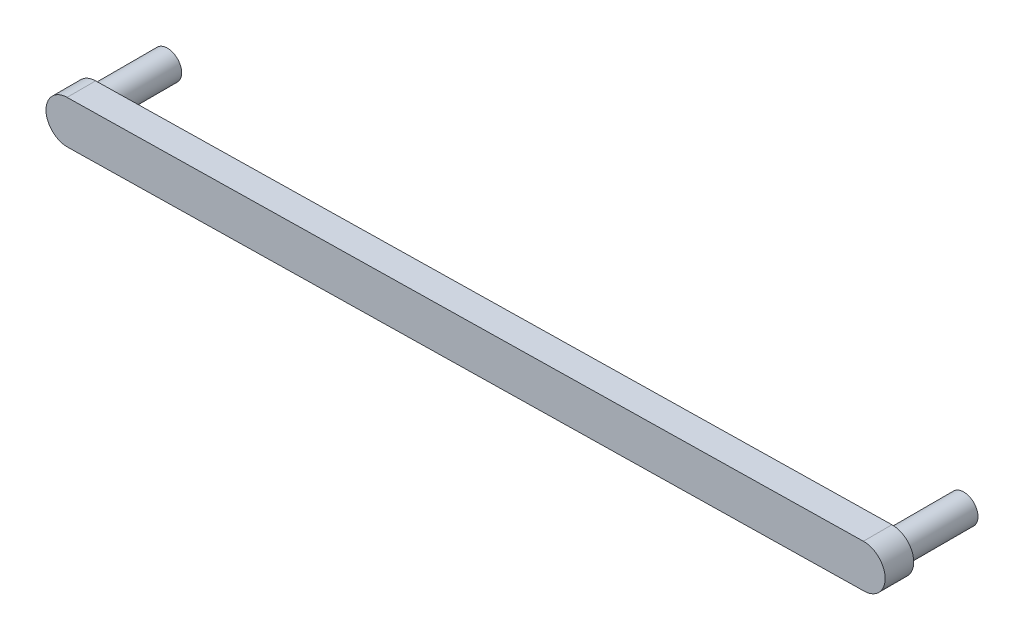
ISO-10303-21;
HEADER;
FILE_DESCRIPTION(('STEP AP214'),'2;1');
FILE_NAME('part.step','',(''),(''),'','','');
FILE_SCHEMA(('AUTOMOTIVE_DESIGN { 1 0 10303 214 1 1 1 1 }'));
ENDSEC;
DATA;
#1=APPLICATION_CONTEXT('core data for automotive mechanical design processes');
#2=APPLICATION_PROTOCOL_DEFINITION('international standard','automotive_design',2000,#1);
#3=PRODUCT_CONTEXT('',#1,'mechanical');
#4=PRODUCT('Part','Part','',(#3));
#5=PRODUCT_RELATED_PRODUCT_CATEGORY('part','',(#4));
#6=PRODUCT_DEFINITION_FORMATION('','',#4);
#7=PRODUCT_DEFINITION_CONTEXT('part definition',#1,'design');
#8=PRODUCT_DEFINITION('design','',#6,#7);
#9=PRODUCT_DEFINITION_SHAPE('','',#8);
#10=(LENGTH_UNIT() NAMED_UNIT(*) SI_UNIT(.MILLI.,.METRE.));
#11=(NAMED_UNIT(*) PLANE_ANGLE_UNIT() SI_UNIT($,.RADIAN.));
#12=(NAMED_UNIT(*) SI_UNIT($,.STERADIAN.) SOLID_ANGLE_UNIT());
#13=UNCERTAINTY_MEASURE_WITH_UNIT(LENGTH_MEASURE(1.E-05),#10,'distance_accuracy_value','');
#14=(GEOMETRIC_REPRESENTATION_CONTEXT(3) GLOBAL_UNCERTAINTY_ASSIGNED_CONTEXT((#13)) GLOBAL_UNIT_ASSIGNED_CONTEXT((#10,
#11,#12)) REPRESENTATION_CONTEXT('',''));
#15=CARTESIAN_POINT('',(0.,0.,0.));
#16=DIRECTION('',(0.,0.,1.));
#17=DIRECTION('',(1.,0.,0.));
#18=AXIS2_PLACEMENT_3D('',#15,#16,#17);
#19=CARTESIAN_POINT('',(0.,-14.9999999999999,2.));
#20=DIRECTION('',(0.,0.,-1.));
#21=DIRECTION('',(-1.,0.,0.));
#22=AXIS2_PLACEMENT_3D('',#19,#20,#21);
#23=CYLINDRICAL_SURFACE('',#22,1.5);
#24=CARTESIAN_POINT('',(0.,-14.9999999999999,0.));
#25=DIRECTION('',(0.,0.,1.));
#26=DIRECTION('',(1.,0.,0.));
#27=AXIS2_PLACEMENT_3D('',#24,#25,#26);
#28=CIRCLE('',#27,1.5);
#29=CARTESIAN_POINT('',(-0.0259093270383533,-13.5002237811017,0.));
#30=VERTEX_POINT('',#29);
#31=CARTESIAN_POINT('',(0.0259093270383072,-16.499776218898,0.));
#32=VERTEX_POINT('',#31);
#33=EDGE_CURVE('E96',#30,#32,#28,.T.);
#34=ORIENTED_EDGE('',*,*,#33,.T.);
#35=DIRECTION('',(0.,0.,-1.));
#36=VECTOR('',#35,1.);
#37=CARTESIAN_POINT('',(0.0259093270383072,-16.499776218898,2.));
#38=LINE('',#37,#36);
#39=CARTESIAN_POINT('',(0.0259093270383072,-16.499776218898,2.));
#40=VERTEX_POINT('',#39);
#41=EDGE_CURVE('E11',#40,#32,#38,.T.);
#42=ORIENTED_EDGE('',*,*,#41,.F.);
#43=CARTESIAN_POINT('',(0.,-14.9999999999999,2.));
#44=DIRECTION('',(0.,0.,1.));
#45=DIRECTION('',(1.,0.,0.));
#46=AXIS2_PLACEMENT_3D('',#43,#44,#45);
#47=CIRCLE('',#46,1.5);
#48=CARTESIAN_POINT('',(-0.0259093270383533,-13.5002237811017,2.));
#49=VERTEX_POINT('',#48);
#50=EDGE_CURVE('E82',#49,#40,#47,.T.);
#51=ORIENTED_EDGE('',*,*,#50,.F.);
#52=DIRECTION('',(0.,0.,-1.));
#53=VECTOR('',#52,1.);
#54=CARTESIAN_POINT('',(-0.0259093270383533,-13.5002237811017,2.));
#55=LINE('',#54,#53);
#56=EDGE_CURVE('E49',#49,#30,#55,.T.);
#57=ORIENTED_EDGE('',*,*,#56,.T.);
#58=EDGE_LOOP('',(#34,#42,#51,#57));
#59=FACE_BOUND('',#58,.T.);
#60=ADVANCED_FACE('F33',(#59),#23,.T.);
#61=CARTESIAN_POINT('',(0.0259093270383072,-16.499776218898,2.));
#62=DIRECTION('',(-0.0172728846922202,0.999850812598764,0.));
#63=DIRECTION('',(-0.999850812598764,-0.0172728846922202,0.));
#64=AXIS2_PLACEMENT_3D('',#61,#62,#63);
#65=PLANE('',#64);
#66=DIRECTION('',(0.999850812598764,0.0172728846922202,0.));
#67=VECTOR('',#66,1.);
#68=CARTESIAN_POINT('',(0.0259093270383072,-16.499776218898,0.));
#69=LINE('',#68,#67);
#70=CARTESIAN_POINT('',(55.779080558548,-15.5366144293862,0.));
#71=VERTEX_POINT('',#70);
#72=EDGE_CURVE('E87',#32,#71,#69,.T.);
#73=ORIENTED_EDGE('',*,*,#72,.T.);
#74=DIRECTION('',(0.,0.,-1.));
#75=VECTOR('',#74,1.);
#76=CARTESIAN_POINT('',(55.779080558548,-15.5366144293862,2.));
#77=LINE('',#76,#75);
#78=CARTESIAN_POINT('',(55.779080558548,-15.5366144293862,2.));
#79=VERTEX_POINT('',#78);
#80=EDGE_CURVE('E41',#79,#71,#77,.T.);
#81=ORIENTED_EDGE('',*,*,#80,.F.);
#82=DIRECTION('',(0.999850812598764,0.0172728846922202,0.));
#83=VECTOR('',#82,1.);
#84=CARTESIAN_POINT('',(0.0259093270383072,-16.499776218898,2.));
#85=LINE('',#84,#83);
#86=EDGE_CURVE('E75',#40,#79,#85,.T.);
#87=ORIENTED_EDGE('',*,*,#86,.F.);
#88=ORIENTED_EDGE('',*,*,#41,.T.);
#89=EDGE_LOOP('',(#73,#81,#87,#88));
#90=FACE_BOUND('',#89,.T.);
#91=ADVANCED_FACE('F86',(#90),#65,.F.);
#92=CARTESIAN_POINT('',(55.7531712315096,-14.036838210488,2.));
#93=DIRECTION('',(0.,0.,-1.));
#94=DIRECTION('',(-1.,0.,0.));
#95=AXIS2_PLACEMENT_3D('',#92,#93,#94);
#96=CYLINDRICAL_SURFACE('',#95,1.5);
#97=CARTESIAN_POINT('',(55.7531712315096,-14.036838210488,0.));
#98=DIRECTION('',(0.,0.,1.));
#99=DIRECTION('',(1.,0.,0.));
#100=AXIS2_PLACEMENT_3D('',#97,#98,#99);
#101=CIRCLE('',#100,1.5);
#102=CARTESIAN_POINT('',(55.7272619044713,-12.5370619915899,0.));
#103=VERTEX_POINT('',#102);
#104=EDGE_CURVE('E100',#71,#103,#101,.T.);
#105=ORIENTED_EDGE('',*,*,#104,.T.);
#106=DIRECTION('',(0.,0.,-1.));
#107=VECTOR('',#106,1.);
#108=CARTESIAN_POINT('',(55.7272619044713,-12.5370619915899,2.));
#109=LINE('',#108,#107);
#110=CARTESIAN_POINT('',(55.7272619044713,-12.5370619915899,2.));
#111=VERTEX_POINT('',#110);
#112=EDGE_CURVE('E64',#111,#103,#109,.T.);
#113=ORIENTED_EDGE('',*,*,#112,.F.);
#114=CARTESIAN_POINT('',(55.7531712315096,-14.036838210488,2.));
#115=DIRECTION('',(0.,0.,1.));
#116=DIRECTION('',(1.,0.,0.));
#117=AXIS2_PLACEMENT_3D('',#114,#115,#116);
#118=CIRCLE('',#117,1.5);
#119=EDGE_CURVE('E81',#79,#111,#118,.T.);
#120=ORIENTED_EDGE('',*,*,#119,.F.);
#121=ORIENTED_EDGE('',*,*,#80,.T.);
#122=EDGE_LOOP('',(#105,#113,#120,#121));
#123=FACE_BOUND('',#122,.T.);
#124=ADVANCED_FACE('F90',(#123),#96,.T.);
#125=CARTESIAN_POINT('',(-0.0259093270383533,-13.5002237811017,2.));
#126=DIRECTION('',(-0.0172728846922201,0.999850812598764,0.));
#127=DIRECTION('',(-0.999850812598764,-0.0172728846922201,0.));
#128=AXIS2_PLACEMENT_3D('',#125,#126,#127);
#129=PLANE('',#128);
#130=DIRECTION('',(0.999850812598764,0.0172728846922201,0.));
#131=VECTOR('',#130,1.);
#132=CARTESIAN_POINT('',(-0.0259093270383533,-13.5002237811017,0.));
#133=LINE('',#132,#131);
#134=EDGE_CURVE('E102',#30,#103,#133,.T.);
#135=ORIENTED_EDGE('',*,*,#134,.F.);
#136=ORIENTED_EDGE('',*,*,#56,.F.);
#137=DIRECTION('',(0.999850812598764,0.0172728846922201,0.));
#138=VECTOR('',#137,1.);
#139=CARTESIAN_POINT('',(-0.0259093270383533,-13.5002237811017,2.));
#140=LINE('',#139,#138);
#141=EDGE_CURVE('E91',#49,#111,#140,.T.);
#142=ORIENTED_EDGE('',*,*,#141,.T.);
#143=ORIENTED_EDGE('',*,*,#112,.T.);
#144=EDGE_LOOP('',(#135,#136,#142,#143));
#145=FACE_BOUND('',#144,.T.);
#146=ADVANCED_FACE('F142',(#145),#129,.T.);
#147=CARTESIAN_POINT('',(0.,-14.9999999999999,2.));
#148=DIRECTION('',(0.,0.,1.));
#149=DIRECTION('',(1.,0.,0.));
#150=AXIS2_PLACEMENT_3D('',#147,#148,#149);
#151=PLANE('',#150);
#152=ORIENTED_EDGE('',*,*,#50,.T.);
#153=ORIENTED_EDGE('',*,*,#86,.T.);
#154=ORIENTED_EDGE('',*,*,#119,.T.);
#155=ORIENTED_EDGE('',*,*,#141,.F.);
#156=EDGE_LOOP('',(#152,#153,#154,#155));
#157=FACE_BOUND('',#156,.T.);
#158=ADVANCED_FACE('F78',(#157),#151,.T.);
#159=CARTESIAN_POINT('',(0.,-14.9999999999999,0.));
#160=DIRECTION('',(0.,0.,1.));
#161=DIRECTION('',(1.,0.,0.));
#162=AXIS2_PLACEMENT_3D('',#159,#160,#161);
#163=PLANE('',#162);
#164=CARTESIAN_POINT('',(55.7531712315096,-14.036838210488,0.));
#165=DIRECTION('',(0.,0.,1.));
#166=DIRECTION('',(1.,0.,0.));
#167=AXIS2_PLACEMENT_3D('',#164,#165,#166);
#168=CIRCLE('',#167,1.00000000000001);
#169=CARTESIAN_POINT('',(56.7531712315096,-14.036838210488,0.));
#170=VERTEX_POINT('',#169);
#171=EDGE_CURVE('E111',#170,#170,#168,.T.);
#172=ORIENTED_EDGE('',*,*,#171,.T.);
#173=EDGE_LOOP('',(#172));
#174=FACE_BOUND('',#173,.T.);
#175=CARTESIAN_POINT('',(0.,-14.9999999999999,0.));
#176=DIRECTION('',(0.,0.,1.));
#177=DIRECTION('',(1.,0.,0.));
#178=AXIS2_PLACEMENT_3D('',#175,#176,#177);
#179=CIRCLE('',#178,1.);
#180=CARTESIAN_POINT('',(0.999999999999978,-14.9999999999999,0.));
#181=VERTEX_POINT('',#180);
#182=EDGE_CURVE('E108',#181,#181,#179,.T.);
#183=ORIENTED_EDGE('',*,*,#182,.T.);
#184=EDGE_LOOP('',(#183));
#185=FACE_BOUND('',#184,.T.);
#186=ORIENTED_EDGE('',*,*,#33,.F.);
#187=ORIENTED_EDGE('',*,*,#134,.T.);
#188=ORIENTED_EDGE('',*,*,#104,.F.);
#189=ORIENTED_EDGE('',*,*,#72,.F.);
#190=EDGE_LOOP('',(#186,#187,#188,#189));
#191=FACE_BOUND('',#190,.T.);
#192=ADVANCED_FACE('F120',(#174,#185,#191),#163,.F.);
#193=CARTESIAN_POINT('',(0.,-14.9999999999999,-5.));
#194=DIRECTION('',(0.,0.,1.));
#195=DIRECTION('',(1.,0.,0.));
#196=AXIS2_PLACEMENT_3D('',#193,#194,#195);
#197=CYLINDRICAL_SURFACE('',#196,1.);
#198=CARTESIAN_POINT('',(0.,-14.9999999999999,-5.));
#199=DIRECTION('',(0.,0.,1.));
#200=DIRECTION('',(1.,0.,0.));
#201=AXIS2_PLACEMENT_3D('',#198,#199,#200);
#202=CIRCLE('',#201,1.);
#203=CARTESIAN_POINT('',(0.999999999999978,-14.9999999999999,-5.));
#204=VERTEX_POINT('',#203);
#205=EDGE_CURVE('E98',#204,#204,#202,.T.);
#206=ORIENTED_EDGE('',*,*,#205,.T.);
#207=EDGE_LOOP('',(#206));
#208=FACE_BOUND('',#207,.T.);
#209=ORIENTED_EDGE('',*,*,#182,.F.);
#210=EDGE_LOOP('',(#209));
#211=FACE_BOUND('',#210,.T.);
#212=ADVANCED_FACE('F135',(#208,#211),#197,.T.);
#213=CARTESIAN_POINT('',(0.,-14.9999999999999,-5.));
#214=DIRECTION('',(0.,0.,1.));
#215=DIRECTION('',(1.,0.,0.));
#216=AXIS2_PLACEMENT_3D('',#213,#214,#215);
#217=PLANE('',#216);
#218=ORIENTED_EDGE('',*,*,#205,.F.);
#219=EDGE_LOOP('',(#218));
#220=FACE_BOUND('',#219,.T.);
#221=ADVANCED_FACE('F126',(#220),#217,.F.);
#222=CARTESIAN_POINT('',(55.7531712315096,-14.036838210488,-5.));
#223=DIRECTION('',(0.,0.,1.));
#224=DIRECTION('',(1.,0.,0.));
#225=AXIS2_PLACEMENT_3D('',#222,#223,#224);
#226=CYLINDRICAL_SURFACE('',#225,1.00000000000001);
#227=CARTESIAN_POINT('',(55.7531712315096,-14.036838210488,-5.));
#228=DIRECTION('',(0.,0.,1.));
#229=DIRECTION('',(1.,0.,0.));
#230=AXIS2_PLACEMENT_3D('',#227,#228,#229);
#231=CIRCLE('',#230,1.00000000000001);
#232=CARTESIAN_POINT('',(56.7531712315096,-14.036838210488,-5.));
#233=VERTEX_POINT('',#232);
#234=EDGE_CURVE('E114',#233,#233,#231,.T.);
#235=ORIENTED_EDGE('',*,*,#234,.T.);
#236=EDGE_LOOP('',(#235));
#237=FACE_BOUND('',#236,.T.);
#238=ORIENTED_EDGE('',*,*,#171,.F.);
#239=EDGE_LOOP('',(#238));
#240=FACE_BOUND('',#239,.T.);
#241=ADVANCED_FACE('F123',(#237,#240),#226,.T.);
#242=CARTESIAN_POINT('',(55.7531712315096,-14.036838210488,-5.));
#243=DIRECTION('',(0.,0.,1.));
#244=DIRECTION('',(1.,0.,0.));
#245=AXIS2_PLACEMENT_3D('',#242,#243,#244);
#246=PLANE('',#245);
#247=ORIENTED_EDGE('',*,*,#234,.F.);
#248=EDGE_LOOP('',(#247));
#249=FACE_BOUND('',#248,.T.);
#250=ADVANCED_FACE('F125',(#249),#246,.F.);
#251=CLOSED_SHELL('',(#60,#91,#124,#146,#158,#192,#212,#221,#241,#250));
#252=MANIFOLD_SOLID_BREP('B2',#251);
#253=ADVANCED_BREP_SHAPE_REPRESENTATION('',(#18,#252),#14);
#254=SHAPE_DEFINITION_REPRESENTATION(#9,#253);
ENDSEC;
END-ISO-10303-21;
